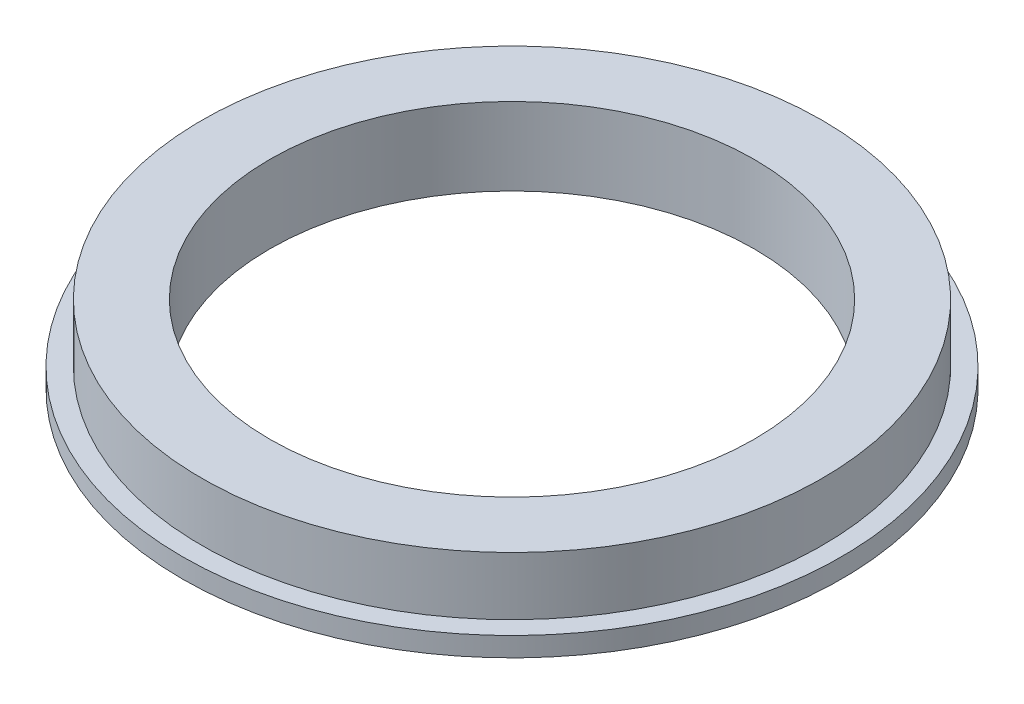
ISO-10303-21;
HEADER;
FILE_DESCRIPTION(('STEP AP214'),'2;1');
FILE_NAME('part.step','',(''),(''),'','','');
FILE_SCHEMA(('AUTOMOTIVE_DESIGN { 1 0 10303 214 1 1 1 1 }'));
ENDSEC;
DATA;
#1=APPLICATION_CONTEXT('core data for automotive mechanical design processes');
#2=APPLICATION_PROTOCOL_DEFINITION('international standard','automotive_design',2000,#1);
#3=PRODUCT_CONTEXT('',#1,'mechanical');
#4=PRODUCT('Part','Part','',(#3));
#5=PRODUCT_RELATED_PRODUCT_CATEGORY('part','',(#4));
#6=PRODUCT_DEFINITION_FORMATION('','',#4);
#7=PRODUCT_DEFINITION_CONTEXT('part definition',#1,'design');
#8=PRODUCT_DEFINITION('design','',#6,#7);
#9=PRODUCT_DEFINITION_SHAPE('','',#8);
#10=(LENGTH_UNIT() NAMED_UNIT(*) SI_UNIT(.MILLI.,.METRE.));
#11=(NAMED_UNIT(*) PLANE_ANGLE_UNIT() SI_UNIT($,.RADIAN.));
#12=(NAMED_UNIT(*) SI_UNIT($,.STERADIAN.) SOLID_ANGLE_UNIT());
#13=UNCERTAINTY_MEASURE_WITH_UNIT(LENGTH_MEASURE(1.E-05),#10,'distance_accuracy_value','');
#14=(GEOMETRIC_REPRESENTATION_CONTEXT(3) GLOBAL_UNCERTAINTY_ASSIGNED_CONTEXT((#13)) GLOBAL_UNIT_ASSIGNED_CONTEXT((#10,
#11,#12)) REPRESENTATION_CONTEXT('',''));
#15=CARTESIAN_POINT('',(0.,0.,0.));
#16=DIRECTION('',(0.,0.,1.));
#17=DIRECTION('',(1.,0.,0.));
#18=AXIS2_PLACEMENT_3D('',#15,#16,#17);
#19=CARTESIAN_POINT('',(0.,-1.20089054194686,0.));
#20=DIRECTION('',(0.,-1.,0.));
#21=DIRECTION('',(0.,0.,-1.));
#22=AXIS2_PLACEMENT_3D('',#19,#20,#21);
#23=CYLINDRICAL_SURFACE('',#22,16.);
#24=CARTESIAN_POINT('',(0.,4.,0.));
#25=DIRECTION('',(0.,-1.,0.));
#26=DIRECTION('',(0.,0.,-1.));
#27=AXIS2_PLACEMENT_3D('',#24,#25,#26);
#28=CIRCLE('',#27,16.);
#29=CARTESIAN_POINT('',(0.,4.,-16.));
#30=VERTEX_POINT('',#29);
#31=EDGE_CURVE('E10',#30,#30,#28,.T.);
#32=ORIENTED_EDGE('',*,*,#31,.T.);
#33=EDGE_LOOP('',(#32));
#34=FACE_BOUND('',#33,.T.);
#35=CARTESIAN_POINT('',(0.,1.,0.));
#36=DIRECTION('',(0.,-1.,0.));
#37=DIRECTION('',(0.,0.,-1.));
#38=AXIS2_PLACEMENT_3D('',#35,#36,#37);
#39=CIRCLE('',#38,16.);
#40=CARTESIAN_POINT('',(0.,1.,-16.));
#41=VERTEX_POINT('',#40);
#42=EDGE_CURVE('E54',#41,#41,#39,.T.);
#43=ORIENTED_EDGE('',*,*,#42,.F.);
#44=EDGE_LOOP('',(#43));
#45=FACE_BOUND('',#44,.T.);
#46=ADVANCED_FACE('F32',(#34,#45),#23,.T.);
#47=CARTESIAN_POINT('',(12.5,4.,0.));
#48=DIRECTION('',(0.,1.,0.));
#49=DIRECTION('',(0.,0.,1.));
#50=AXIS2_PLACEMENT_3D('',#47,#48,#49);
#51=PLANE('',#50);
#52=CARTESIAN_POINT('',(0.,4.,0.));
#53=DIRECTION('',(0.,-1.,0.));
#54=DIRECTION('',(0.,0.,-1.));
#55=AXIS2_PLACEMENT_3D('',#52,#53,#54);
#56=CIRCLE('',#55,12.5);
#57=CARTESIAN_POINT('',(0.,4.,-12.5));
#58=VERTEX_POINT('',#57);
#59=EDGE_CURVE('E38',#58,#58,#56,.T.);
#60=ORIENTED_EDGE('',*,*,#59,.T.);
#61=EDGE_LOOP('',(#60));
#62=FACE_BOUND('',#61,.T.);
#63=ORIENTED_EDGE('',*,*,#31,.F.);
#64=EDGE_LOOP('',(#63));
#65=FACE_BOUND('',#64,.T.);
#66=ADVANCED_FACE('F62',(#62,#65),#51,.T.);
#67=CARTESIAN_POINT('',(0.,-1.20089054194686,0.));
#68=DIRECTION('',(0.,-1.,0.));
#69=DIRECTION('',(0.,0.,-1.));
#70=AXIS2_PLACEMENT_3D('',#67,#68,#69);
#71=CYLINDRICAL_SURFACE('',#70,12.5);
#72=CARTESIAN_POINT('',(0.,0.,0.));
#73=DIRECTION('',(0.,-1.,0.));
#74=DIRECTION('',(0.,0.,-1.));
#75=AXIS2_PLACEMENT_3D('',#72,#73,#74);
#76=CIRCLE('',#75,12.5);
#77=CARTESIAN_POINT('',(0.,0.,-12.5));
#78=VERTEX_POINT('',#77);
#79=EDGE_CURVE('E42',#78,#78,#76,.T.);
#80=ORIENTED_EDGE('',*,*,#79,.T.);
#81=EDGE_LOOP('',(#80));
#82=FACE_BOUND('',#81,.T.);
#83=ORIENTED_EDGE('',*,*,#59,.F.);
#84=EDGE_LOOP('',(#83));
#85=FACE_BOUND('',#84,.T.);
#86=ADVANCED_FACE('F66',(#82,#85),#71,.F.);
#87=CARTESIAN_POINT('',(17.,0.,0.));
#88=DIRECTION('',(0.,-1.,0.));
#89=DIRECTION('',(0.,0.,-1.));
#90=AXIS2_PLACEMENT_3D('',#87,#88,#89);
#91=PLANE('',#90);
#92=CARTESIAN_POINT('',(0.,0.,0.));
#93=DIRECTION('',(0.,-1.,0.));
#94=DIRECTION('',(0.,0.,-1.));
#95=AXIS2_PLACEMENT_3D('',#92,#93,#94);
#96=CIRCLE('',#95,17.);
#97=CARTESIAN_POINT('',(0.,0.,-17.));
#98=VERTEX_POINT('',#97);
#99=EDGE_CURVE('E46',#98,#98,#96,.T.);
#100=ORIENTED_EDGE('',*,*,#99,.T.);
#101=EDGE_LOOP('',(#100));
#102=FACE_BOUND('',#101,.T.);
#103=ORIENTED_EDGE('',*,*,#79,.F.);
#104=EDGE_LOOP('',(#103));
#105=FACE_BOUND('',#104,.T.);
#106=ADVANCED_FACE('F70',(#102,#105),#91,.T.);
#107=CARTESIAN_POINT('',(0.,-1.20089054194686,0.));
#108=DIRECTION('',(0.,-1.,0.));
#109=DIRECTION('',(0.,0.,-1.));
#110=AXIS2_PLACEMENT_3D('',#107,#108,#109);
#111=CYLINDRICAL_SURFACE('',#110,17.);
#112=CARTESIAN_POINT('',(0.,1.,0.));
#113=DIRECTION('',(0.,-1.,0.));
#114=DIRECTION('',(0.,0.,-1.));
#115=AXIS2_PLACEMENT_3D('',#112,#113,#114);
#116=CIRCLE('',#115,17.);
#117=CARTESIAN_POINT('',(0.,1.,-17.));
#118=VERTEX_POINT('',#117);
#119=EDGE_CURVE('E51',#118,#118,#116,.T.);
#120=ORIENTED_EDGE('',*,*,#119,.T.);
#121=EDGE_LOOP('',(#120));
#122=FACE_BOUND('',#121,.T.);
#123=ORIENTED_EDGE('',*,*,#99,.F.);
#124=EDGE_LOOP('',(#123));
#125=FACE_BOUND('',#124,.T.);
#126=ADVANCED_FACE('F77',(#122,#125),#111,.T.);
#127=CARTESIAN_POINT('',(16.,1.,0.));
#128=DIRECTION('',(0.,1.,0.));
#129=DIRECTION('',(0.,0.,1.));
#130=AXIS2_PLACEMENT_3D('',#127,#128,#129);
#131=PLANE('',#130);
#132=ORIENTED_EDGE('',*,*,#42,.T.);
#133=EDGE_LOOP('',(#132));
#134=FACE_BOUND('',#133,.T.);
#135=ORIENTED_EDGE('',*,*,#119,.F.);
#136=EDGE_LOOP('',(#135));
#137=FACE_BOUND('',#136,.T.);
#138=ADVANCED_FACE('F58',(#134,#137),#131,.T.);
#139=CLOSED_SHELL('',(#46,#66,#86,#106,#126,#138));
#140=MANIFOLD_SOLID_BREP('B2',#139);
#141=ADVANCED_BREP_SHAPE_REPRESENTATION('',(#18,#140),#14);
#142=SHAPE_DEFINITION_REPRESENTATION(#9,#141);
ENDSEC;
END-ISO-10303-21;
